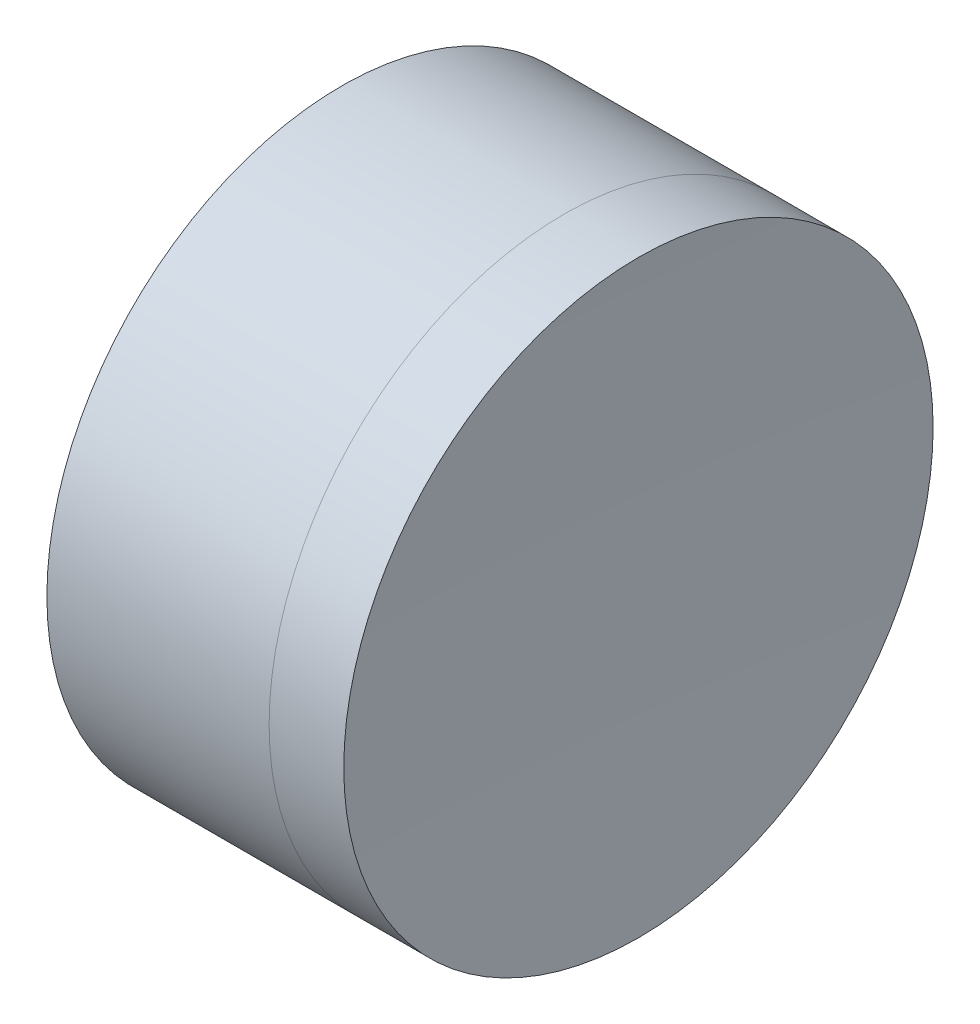
ISO-10303-21;
HEADER;
FILE_DESCRIPTION(('STEP AP214'),'2;1');
FILE_NAME('part.step','',(''),(''),'','','');
FILE_SCHEMA(('AUTOMOTIVE_DESIGN { 1 0 10303 214 1 1 1 1 }'));
ENDSEC;
DATA;
#1=APPLICATION_CONTEXT('core data for automotive mechanical design processes');
#2=APPLICATION_PROTOCOL_DEFINITION('international standard','automotive_design',2000,#1);
#3=PRODUCT_CONTEXT('',#1,'mechanical');
#4=PRODUCT('Part','Part','',(#3));
#5=PRODUCT_RELATED_PRODUCT_CATEGORY('part','',(#4));
#6=PRODUCT_DEFINITION_FORMATION('','',#4);
#7=PRODUCT_DEFINITION_CONTEXT('part definition',#1,'design');
#8=PRODUCT_DEFINITION('design','',#6,#7);
#9=PRODUCT_DEFINITION_SHAPE('','',#8);
#10=(LENGTH_UNIT() NAMED_UNIT(*) SI_UNIT(.MILLI.,.METRE.));
#11=(NAMED_UNIT(*) PLANE_ANGLE_UNIT() SI_UNIT($,.RADIAN.));
#12=(NAMED_UNIT(*) SI_UNIT($,.STERADIAN.) SOLID_ANGLE_UNIT());
#13=UNCERTAINTY_MEASURE_WITH_UNIT(LENGTH_MEASURE(1.E-05),#10,'distance_accuracy_value','');
#14=(GEOMETRIC_REPRESENTATION_CONTEXT(3) GLOBAL_UNCERTAINTY_ASSIGNED_CONTEXT((#13)) GLOBAL_UNIT_ASSIGNED_CONTEXT((#10,
#11,#12)) REPRESENTATION_CONTEXT('',''));
#15=CARTESIAN_POINT('',(0.,0.,0.));
#16=DIRECTION('',(0.,0.,1.));
#17=DIRECTION('',(1.,0.,0.));
#18=AXIS2_PLACEMENT_3D('',#15,#16,#17);
#19=CARTESIAN_POINT('',(177.883174028793,0.,0.));
#20=DIRECTION('',(-1.,0.,0.));
#21=DIRECTION('',(0.,0.,1.));
#22=AXIS2_PLACEMENT_3D('',#19,#20,#21);
#23=SPHERICAL_SURFACE('',#22,14.);
#24=CARTESIAN_POINT('',(165.40609504371,0.,0.));
#25=DIRECTION('',(-1.,0.,0.));
#26=DIRECTION('',(0.,0.,1.));
#27=AXIS2_PLACEMENT_3D('',#24,#25,#26);
#28=CIRCLE('',#27,6.34999999999993);
#29=CARTESIAN_POINT('',(165.40609504371,0.,6.34999999999993));
#30=VERTEX_POINT('',#29);
#31=EDGE_CURVE('E11',#30,#30,#28,.T.);
#32=ORIENTED_EDGE('',*,*,#31,.T.);
#33=EDGE_LOOP('',(#32));
#34=FACE_BOUND('',#33,.T.);
#35=ADVANCED_FACE('F45',(#34),#23,.T.);
#36=CARTESIAN_POINT('',(160.617285286987,0.,0.));
#37=DIRECTION('',(-1.,0.,0.));
#38=DIRECTION('',(0.,0.,1.));
#39=AXIS2_PLACEMENT_3D('',#36,#37,#38);
#40=CYLINDRICAL_SURFACE('',#39,6.34999999999994);
#41=CARTESIAN_POINT('',(167.015176399951,0.,0.));
#42=DIRECTION('',(-1.,0.,0.));
#43=DIRECTION('',(0.,0.,1.));
#44=AXIS2_PLACEMENT_3D('',#41,#42,#43);
#45=CIRCLE('',#44,6.34999999999994);
#46=CARTESIAN_POINT('',(167.015176399951,0.,6.34999999999994));
#47=VERTEX_POINT('',#46);
#48=EDGE_CURVE('E51',#47,#47,#45,.T.);
#49=ORIENTED_EDGE('',*,*,#48,.T.);
#50=EDGE_LOOP('',(#49));
#51=FACE_BOUND('',#50,.T.);
#52=ORIENTED_EDGE('',*,*,#31,.F.);
#53=EDGE_LOOP('',(#52));
#54=FACE_BOUND('',#53,.T.);
#55=ADVANCED_FACE('F57',(#51,#54),#40,.T.);
#56=CARTESIAN_POINT('',(319.683174028793,0.,0.));
#57=DIRECTION('',(-1.,0.,0.));
#58=DIRECTION('',(0.,0.,-1.));
#59=AXIS2_PLACEMENT_3D('',#56,#57,#58);
#60=SPHERICAL_SURFACE('',#59,152.8);
#61=ORIENTED_EDGE('',*,*,#48,.F.);
#62=EDGE_LOOP('',(#61));
#63=FACE_BOUND('',#62,.T.);
#64=ADVANCED_FACE('F60',(#63),#60,.F.);
#65=CLOSED_SHELL('',(#35,#55,#64));
#66=MANIFOLD_SOLID_BREP('B2',#65);
#67=CARTESIAN_POINT('',(150.083174028793,0.,0.));
#68=DIRECTION('',(-1.,0.,0.));
#69=DIRECTION('',(0.,0.,1.));
#70=AXIS2_PLACEMENT_3D('',#67,#68,#69);
#71=SPHERICAL_SURFACE('',#70,12.3);
#72=CARTESIAN_POINT('',(160.617285286987,0.,0.));
#73=DIRECTION('',(-1.,0.,0.));
#74=DIRECTION('',(0.,0.,1.));
#75=AXIS2_PLACEMENT_3D('',#72,#73,#74);
#76=CIRCLE('',#75,6.34999999999999);
#77=CARTESIAN_POINT('',(160.617285286987,0.,6.34999999999994));
#78=VERTEX_POINT('',#77);
#79=EDGE_CURVE('E44',#78,#78,#76,.T.);
#80=ORIENTED_EDGE('',*,*,#79,.T.);
#81=EDGE_LOOP('',(#80));
#82=FACE_BOUND('',#81,.T.);
#83=ADVANCED_FACE('F86',(#82),#71,.F.);
#84=CARTESIAN_POINT('',(-185.274474050658,0.,0.));
#85=DIRECTION('',(-1.,0.,0.));
#86=DIRECTION('',(0.,0.,1.));
#87=AXIS2_PLACEMENT_3D('',#84,#85,#86);
#88=CYLINDRICAL_SURFACE('',#87,6.34999999999999);
#89=CARTESIAN_POINT('',(165.40609504371,0.,0.));
#90=DIRECTION('',(-1.,0.,0.));
#91=DIRECTION('',(0.,0.,1.));
#92=AXIS2_PLACEMENT_3D('',#89,#90,#91);
#93=CIRCLE('',#92,6.34999999999999);
#94=CARTESIAN_POINT('',(165.40609504371,0.,6.34999999999994));
#95=VERTEX_POINT('',#94);
#96=EDGE_CURVE('E92',#95,#95,#93,.T.);
#97=ORIENTED_EDGE('',*,*,#96,.T.);
#98=EDGE_LOOP('',(#97));
#99=FACE_BOUND('',#98,.T.);
#100=ORIENTED_EDGE('',*,*,#79,.F.);
#101=EDGE_LOOP('',(#100));
#102=FACE_BOUND('',#101,.T.);
#103=ADVANCED_FACE('F98',(#99,#102),#88,.T.);
#104=CARTESIAN_POINT('',(177.883174028793,0.,0.));
#105=DIRECTION('',(-1.,0.,0.));
#106=DIRECTION('',(0.,0.,1.));
#107=AXIS2_PLACEMENT_3D('',#104,#105,#106);
#108=SPHERICAL_SURFACE('',#107,14.);
#109=ORIENTED_EDGE('',*,*,#96,.F.);
#110=EDGE_LOOP('',(#109));
#111=FACE_BOUND('',#110,.T.);
#112=ADVANCED_FACE('F101',(#111),#108,.F.);
#113=CLOSED_SHELL('',(#83,#103,#112));
#114=MANIFOLD_SOLID_BREP('B6',#113);
#115=ADVANCED_BREP_SHAPE_REPRESENTATION('',(#18,#66,#114),#14);
#116=SHAPE_DEFINITION_REPRESENTATION(#9,#115);
ENDSEC;
END-ISO-10303-21;
